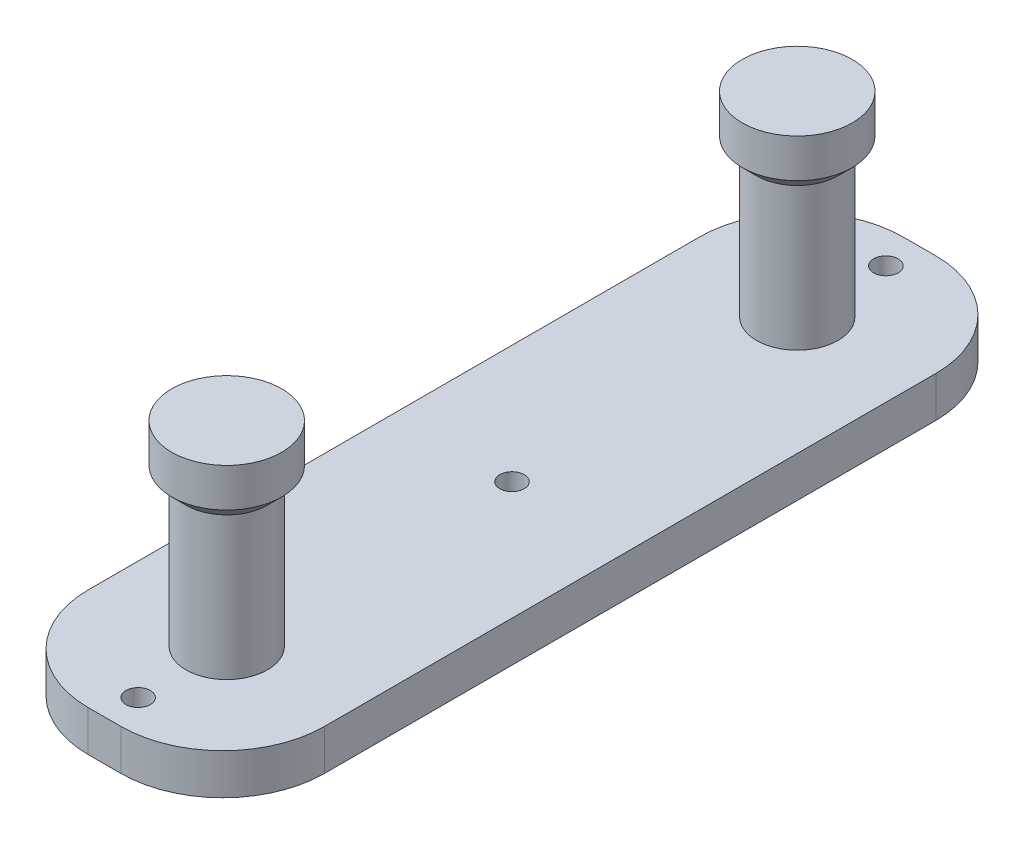
ISO-10303-21;
HEADER;
FILE_DESCRIPTION(('STEP AP214'),'2;1');
FILE_NAME('part.step','',(''),(''),'','','');
FILE_SCHEMA(('AUTOMOTIVE_DESIGN { 1 0 10303 214 1 1 1 1 }'));
ENDSEC;
DATA;
#1=APPLICATION_CONTEXT('core data for automotive mechanical design processes');
#2=APPLICATION_PROTOCOL_DEFINITION('international standard','automotive_design',2000,#1);
#3=PRODUCT_CONTEXT('',#1,'mechanical');
#4=PRODUCT('Part','Part','',(#3));
#5=PRODUCT_RELATED_PRODUCT_CATEGORY('part','',(#4));
#6=PRODUCT_DEFINITION_FORMATION('','',#4);
#7=PRODUCT_DEFINITION_CONTEXT('part definition',#1,'design');
#8=PRODUCT_DEFINITION('design','',#6,#7);
#9=PRODUCT_DEFINITION_SHAPE('','',#8);
#10=(LENGTH_UNIT() NAMED_UNIT(*) SI_UNIT(.MILLI.,.METRE.));
#11=(NAMED_UNIT(*) PLANE_ANGLE_UNIT() SI_UNIT($,.RADIAN.));
#12=(NAMED_UNIT(*) SI_UNIT($,.STERADIAN.) SOLID_ANGLE_UNIT());
#13=UNCERTAINTY_MEASURE_WITH_UNIT(LENGTH_MEASURE(1.E-05),#10,'distance_accuracy_value','');
#14=(GEOMETRIC_REPRESENTATION_CONTEXT(3) GLOBAL_UNCERTAINTY_ASSIGNED_CONTEXT((#13)) GLOBAL_UNIT_ASSIGNED_CONTEXT((#10,
#11,#12)) REPRESENTATION_CONTEXT('',''));
#15=CARTESIAN_POINT('',(0.,0.,0.));
#16=DIRECTION('',(0.,0.,1.));
#17=DIRECTION('',(1.,0.,0.));
#18=AXIS2_PLACEMENT_3D('',#15,#16,#17);
#19=CARTESIAN_POINT('',(-27.6995515695067,10.,0.));
#20=DIRECTION('',(1.,0.,0.));
#21=DIRECTION('',(0.,0.,-1.));
#22=AXIS2_PLACEMENT_3D('',#19,#20,#21);
#23=PLANE('',#22);
#24=DIRECTION('',(0.,0.,1.));
#25=VECTOR('',#24,1.);
#26=CARTESIAN_POINT('',(-27.6995515695067,10.,0.));
#27=LINE('',#26,#25);
#28=CARTESIAN_POINT('',(-27.6995515695067,10.,-5.23542600896859));
#29=VERTEX_POINT('',#28);
#30=CARTESIAN_POINT('',(-27.6995515695067,10.,144.764573991031));
#31=VERTEX_POINT('',#30);
#32=EDGE_CURVE('E131',#29,#31,#27,.T.);
#33=ORIENTED_EDGE('',*,*,#32,.F.);
#34=DIRECTION('',(0.,-1.,0.));
#35=VECTOR('',#34,1.);
#36=CARTESIAN_POINT('',(-27.6995515695067,0.,-5.23542600896859));
#37=LINE('',#36,#35);
#38=CARTESIAN_POINT('',(-27.6995515695067,0.,-5.23542600896859));
#39=VERTEX_POINT('',#38);
#40=EDGE_CURVE('E116',#29,#39,#37,.T.);
#41=ORIENTED_EDGE('',*,*,#40,.T.);
#42=DIRECTION('',(0.,0.,1.));
#43=VECTOR('',#42,1.);
#44=CARTESIAN_POINT('',(-27.6995515695067,0.,0.));
#45=LINE('',#44,#43);
#46=CARTESIAN_POINT('',(-27.6995515695067,0.,144.764573991031));
#47=VERTEX_POINT('',#46);
#48=EDGE_CURVE('E128',#39,#47,#45,.T.);
#49=ORIENTED_EDGE('',*,*,#48,.T.);
#50=DIRECTION('',(0.,-1.,0.));
#51=VECTOR('',#50,1.);
#52=CARTESIAN_POINT('',(-27.6995515695067,10.,144.764573991031));
#53=LINE('',#52,#51);
#54=EDGE_CURVE('E133',#47,#31,#53,.F.);
#55=ORIENTED_EDGE('',*,*,#54,.T.);
#56=EDGE_LOOP('',(#33,#41,#49,#55));
#57=FACE_BOUND('',#56,.T.);
#58=ADVANCED_FACE('F45',(#57),#23,.F.);
#59=CARTESIAN_POINT('',(0.,10.,169.764573991031));
#60=DIRECTION('',(0.,0.,-1.));
#61=DIRECTION('',(-1.,0.,0.));
#62=AXIS2_PLACEMENT_3D('',#59,#60,#61);
#63=PLANE('',#62);
#64=DIRECTION('',(1.,0.,0.));
#65=VECTOR('',#64,1.);
#66=CARTESIAN_POINT('',(0.,10.,169.764573991031));
#67=LINE('',#66,#65);
#68=CARTESIAN_POINT('',(-2.69955156950669,10.,169.764573991031));
#69=VERTEX_POINT('',#68);
#70=CARTESIAN_POINT('',(5.30044843049331,10.,169.764573991031));
#71=VERTEX_POINT('',#70);
#72=EDGE_CURVE('E188',#69,#71,#67,.T.);
#73=ORIENTED_EDGE('',*,*,#72,.F.);
#74=DIRECTION('',(0.,-1.,0.));
#75=VECTOR('',#74,1.);
#76=CARTESIAN_POINT('',(-2.69955156950669,10.,169.764573991031));
#77=LINE('',#76,#75);
#78=CARTESIAN_POINT('',(-2.69955156950669,0.,169.764573991031));
#79=VERTEX_POINT('',#78);
#80=EDGE_CURVE('E11',#69,#79,#77,.T.);
#81=ORIENTED_EDGE('',*,*,#80,.T.);
#82=DIRECTION('',(1.,0.,0.));
#83=VECTOR('',#82,1.);
#84=CARTESIAN_POINT('',(0.,0.,169.764573991031));
#85=LINE('',#84,#83);
#86=CARTESIAN_POINT('',(5.30044843049331,0.,169.764573991031));
#87=VERTEX_POINT('',#86);
#88=EDGE_CURVE('E138',#79,#87,#85,.T.);
#89=ORIENTED_EDGE('',*,*,#88,.T.);
#90=DIRECTION('',(0.,-1.,0.));
#91=VECTOR('',#90,1.);
#92=CARTESIAN_POINT('',(5.30044843049331,10.,169.764573991031));
#93=LINE('',#92,#91);
#94=EDGE_CURVE('E53',#87,#71,#93,.F.);
#95=ORIENTED_EDGE('',*,*,#94,.T.);
#96=EDGE_LOOP('',(#73,#81,#89,#95));
#97=FACE_BOUND('',#96,.T.);
#98=ADVANCED_FACE('F187',(#97),#63,.F.);
#99=CARTESIAN_POINT('',(30.3004484304933,10.,0.));
#100=DIRECTION('',(1.,0.,0.));
#101=DIRECTION('',(0.,0.,-1.));
#102=AXIS2_PLACEMENT_3D('',#99,#100,#101);
#103=PLANE('',#102);
#104=DIRECTION('',(0.,0.,1.));
#105=VECTOR('',#104,1.);
#106=CARTESIAN_POINT('',(30.3004484304933,0.,0.));
#107=LINE('',#106,#105);
#108=CARTESIAN_POINT('',(30.3004484304933,0.,-5.2354260089686));
#109=VERTEX_POINT('',#108);
#110=CARTESIAN_POINT('',(30.3004484304933,0.,144.764573991031));
#111=VERTEX_POINT('',#110);
#112=EDGE_CURVE('E142',#109,#111,#107,.T.);
#113=ORIENTED_EDGE('',*,*,#112,.F.);
#114=DIRECTION('',(0.,-1.,0.));
#115=VECTOR('',#114,1.);
#116=CARTESIAN_POINT('',(30.3004484304933,10.,-5.2354260089686));
#117=LINE('',#116,#115);
#118=CARTESIAN_POINT('',(30.3004484304933,10.,-5.2354260089686));
#119=VERTEX_POINT('',#118);
#120=EDGE_CURVE('E67',#109,#119,#117,.F.);
#121=ORIENTED_EDGE('',*,*,#120,.T.);
#122=DIRECTION('',(0.,0.,1.));
#123=VECTOR('',#122,1.);
#124=CARTESIAN_POINT('',(30.3004484304933,10.,0.));
#125=LINE('',#124,#123);
#126=CARTESIAN_POINT('',(30.3004484304933,10.,144.764573991031));
#127=VERTEX_POINT('',#126);
#128=EDGE_CURVE('E194',#119,#127,#125,.T.);
#129=ORIENTED_EDGE('',*,*,#128,.T.);
#130=DIRECTION('',(0.,-1.,0.));
#131=VECTOR('',#130,1.);
#132=CARTESIAN_POINT('',(30.3004484304933,0.,144.764573991031));
#133=LINE('',#132,#131);
#134=EDGE_CURVE('E181',#127,#111,#133,.T.);
#135=ORIENTED_EDGE('',*,*,#134,.T.);
#136=EDGE_LOOP('',(#113,#121,#129,#135));
#137=FACE_BOUND('',#136,.T.);
#138=ADVANCED_FACE('F197',(#137),#103,.T.);
#139=CARTESIAN_POINT('',(0.,10.,-30.2354260089686));
#140=DIRECTION('',(0.,0.,-1.));
#141=DIRECTION('',(-1.,0.,0.));
#142=AXIS2_PLACEMENT_3D('',#139,#140,#141);
#143=PLANE('',#142);
#144=DIRECTION('',(1.,0.,0.));
#145=VECTOR('',#144,1.);
#146=CARTESIAN_POINT('',(0.,0.,-30.2354260089686));
#147=LINE('',#146,#145);
#148=CARTESIAN_POINT('',(-2.69955156950671,0.,-30.2354260089686));
#149=VERTEX_POINT('',#148);
#150=CARTESIAN_POINT('',(5.30044843049329,0.,-30.2354260089686));
#151=VERTEX_POINT('',#150);
#152=EDGE_CURVE('E153',#149,#151,#147,.T.);
#153=ORIENTED_EDGE('',*,*,#152,.F.);
#154=DIRECTION('',(0.,-1.,0.));
#155=VECTOR('',#154,1.);
#156=CARTESIAN_POINT('',(-2.69955156950671,10.,-30.2354260089686));
#157=LINE('',#156,#155);
#158=CARTESIAN_POINT('',(-2.69955156950671,10.,-30.2354260089686));
#159=VERTEX_POINT('',#158);
#160=EDGE_CURVE('E117',#149,#159,#157,.F.);
#161=ORIENTED_EDGE('',*,*,#160,.T.);
#162=DIRECTION('',(1.,0.,0.));
#163=VECTOR('',#162,1.);
#164=CARTESIAN_POINT('',(0.,10.,-30.2354260089686));
#165=LINE('',#164,#163);
#166=CARTESIAN_POINT('',(5.30044843049329,10.,-30.2354260089686));
#167=VERTEX_POINT('',#166);
#168=EDGE_CURVE('E148',#159,#167,#165,.T.);
#169=ORIENTED_EDGE('',*,*,#168,.T.);
#170=DIRECTION('',(0.,-1.,0.));
#171=VECTOR('',#170,1.);
#172=CARTESIAN_POINT('',(5.30044843049329,10.,-30.2354260089686));
#173=LINE('',#172,#171);
#174=EDGE_CURVE('E122',#167,#151,#173,.T.);
#175=ORIENTED_EDGE('',*,*,#174,.T.);
#176=EDGE_LOOP('',(#153,#161,#169,#175));
#177=FACE_BOUND('',#176,.T.);
#178=ADVANCED_FACE('F204',(#177),#143,.T.);
#179=CARTESIAN_POINT('',(0.,10.,0.));
#180=DIRECTION('',(0.,1.,0.));
#181=DIRECTION('',(0.,0.,1.));
#182=AXIS2_PLACEMENT_3D('',#179,#180,#181);
#183=PLANE('',#182);
#184=CARTESIAN_POINT('',(1.30044843049329,10.,-21.9854260089686));
#185=DIRECTION('',(0.,1.,0.));
#186=DIRECTION('',(0.,0.,1.));
#187=AXIS2_PLACEMENT_3D('',#184,#185,#186);
#188=CIRCLE('',#187,3.);
#189=CARTESIAN_POINT('',(1.30044843049329,10.,-18.9854260089686));
#190=VERTEX_POINT('',#189);
#191=EDGE_CURVE('E228',#190,#190,#188,.T.);
#192=ORIENTED_EDGE('',*,*,#191,.F.);
#193=EDGE_LOOP('',(#192));
#194=FACE_BOUND('',#193,.T.);
#195=CARTESIAN_POINT('',(1.30044843049329,10.,69.7645739910314));
#196=DIRECTION('',(0.,1.,0.));
#197=DIRECTION('',(0.,0.,1.));
#198=AXIS2_PLACEMENT_3D('',#195,#196,#197);
#199=CIRCLE('',#198,3.);
#200=CARTESIAN_POINT('',(1.30044843049329,10.,72.7645739910314));
#201=VERTEX_POINT('',#200);
#202=EDGE_CURVE('E222',#201,#201,#199,.T.);
#203=ORIENTED_EDGE('',*,*,#202,.F.);
#204=EDGE_LOOP('',(#203));
#205=FACE_BOUND('',#204,.T.);
#206=CARTESIAN_POINT('',(1.30044843049331,10.,161.514573991031));
#207=DIRECTION('',(0.,1.,0.));
#208=DIRECTION('',(0.,0.,1.));
#209=AXIS2_PLACEMENT_3D('',#206,#207,#208);
#210=CIRCLE('',#209,3.);
#211=CARTESIAN_POINT('',(1.30044843049331,10.,164.514573991031));
#212=VERTEX_POINT('',#211);
#213=EDGE_CURVE('E216',#212,#212,#210,.T.);
#214=ORIENTED_EDGE('',*,*,#213,.F.);
#215=EDGE_LOOP('',(#214));
#216=FACE_BOUND('',#215,.T.);
#217=CARTESIAN_POINT('',(1.3004484304933,10.,139.764573991031));
#218=DIRECTION('',(0.,1.,0.));
#219=DIRECTION('',(0.,0.,1.));
#220=AXIS2_PLACEMENT_3D('',#217,#218,#219);
#221=CIRCLE('',#220,10.);
#222=CARTESIAN_POINT('',(1.3004484304933,10.,149.764573991031));
#223=VERTEX_POINT('',#222);
#224=EDGE_CURVE('E145',#223,#223,#221,.F.);
#225=ORIENTED_EDGE('',*,*,#224,.T.);
#226=EDGE_LOOP('',(#225));
#227=FACE_BOUND('',#226,.T.);
#228=CARTESIAN_POINT('',(1.30044843049329,10.,-0.235426008968601));
#229=DIRECTION('',(0.,1.,0.));
#230=DIRECTION('',(0.,0.,1.));
#231=AXIS2_PLACEMENT_3D('',#228,#229,#230);
#232=CIRCLE('',#231,10.);
#233=CARTESIAN_POINT('',(1.30044843049329,10.,9.76457399103141));
#234=VERTEX_POINT('',#233);
#235=EDGE_CURVE('E139',#234,#234,#232,.F.);
#236=ORIENTED_EDGE('',*,*,#235,.T.);
#237=EDGE_LOOP('',(#236));
#238=FACE_BOUND('',#237,.T.);
#239=ORIENTED_EDGE('',*,*,#168,.F.);
#240=CARTESIAN_POINT('',(-2.69955156950671,10.,-5.2354260089686));
#241=DIRECTION('',(0.,1.,0.));
#242=DIRECTION('',(0.,0.,1.));
#243=AXIS2_PLACEMENT_3D('',#240,#241,#242);
#244=CIRCLE('',#243,25.);
#245=EDGE_CURVE('E179',#159,#29,#244,.T.);
#246=ORIENTED_EDGE('',*,*,#245,.T.);
#247=ORIENTED_EDGE('',*,*,#32,.T.);
#248=CARTESIAN_POINT('',(-2.69955156950669,10.,144.764573991031));
#249=DIRECTION('',(0.,1.,0.));
#250=DIRECTION('',(0.,0.,1.));
#251=AXIS2_PLACEMENT_3D('',#248,#249,#250);
#252=CIRCLE('',#251,25.);
#253=EDGE_CURVE('E175',#31,#69,#252,.T.);
#254=ORIENTED_EDGE('',*,*,#253,.T.);
#255=ORIENTED_EDGE('',*,*,#72,.T.);
#256=CARTESIAN_POINT('',(5.30044843049331,10.,144.764573991031));
#257=DIRECTION('',(0.,1.,0.));
#258=DIRECTION('',(0.,0.,1.));
#259=AXIS2_PLACEMENT_3D('',#256,#257,#258);
#260=CIRCLE('',#259,25.);
#261=EDGE_CURVE('E60',#71,#127,#260,.T.);
#262=ORIENTED_EDGE('',*,*,#261,.T.);
#263=ORIENTED_EDGE('',*,*,#128,.F.);
#264=CARTESIAN_POINT('',(5.30044843049329,10.,-5.2354260089686));
#265=DIRECTION('',(0.,1.,0.));
#266=DIRECTION('',(0.,0.,1.));
#267=AXIS2_PLACEMENT_3D('',#264,#265,#266);
#268=CIRCLE('',#267,25.);
#269=EDGE_CURVE('E177',#119,#167,#268,.T.);
#270=ORIENTED_EDGE('',*,*,#269,.T.);
#271=EDGE_LOOP('',(#239,#246,#247,#254,#255,#262,#263,#270));
#272=FACE_BOUND('',#271,.T.);
#273=ADVANCED_FACE('F192',(#194,#205,#216,#227,#238,#272),#183,.T.);
#274=CARTESIAN_POINT('',(0.,0.,0.));
#275=DIRECTION('',(0.,1.,0.));
#276=DIRECTION('',(0.,0.,1.));
#277=AXIS2_PLACEMENT_3D('',#274,#275,#276);
#278=PLANE('',#277);
#279=CARTESIAN_POINT('',(1.30044843049329,0.,-21.9854260089686));
#280=DIRECTION('',(0.,1.,0.));
#281=DIRECTION('',(0.,0.,1.));
#282=AXIS2_PLACEMENT_3D('',#279,#280,#281);
#283=CIRCLE('',#282,3.);
#284=CARTESIAN_POINT('',(1.30044843049329,0.,-18.9854260089686));
#285=VERTEX_POINT('',#284);
#286=EDGE_CURVE('E215',#285,#285,#283,.T.);
#287=ORIENTED_EDGE('',*,*,#286,.T.);
#288=EDGE_LOOP('',(#287));
#289=FACE_BOUND('',#288,.T.);
#290=CARTESIAN_POINT('',(1.30044843049329,0.,69.7645739910314));
#291=DIRECTION('',(0.,1.,0.));
#292=DIRECTION('',(0.,0.,1.));
#293=AXIS2_PLACEMENT_3D('',#290,#291,#292);
#294=CIRCLE('',#293,3.);
#295=CARTESIAN_POINT('',(1.30044843049329,0.,72.7645739910314));
#296=VERTEX_POINT('',#295);
#297=EDGE_CURVE('E225',#296,#296,#294,.T.);
#298=ORIENTED_EDGE('',*,*,#297,.T.);
#299=EDGE_LOOP('',(#298));
#300=FACE_BOUND('',#299,.T.);
#301=CARTESIAN_POINT('',(1.30044843049331,0.,161.514573991031));
#302=DIRECTION('',(0.,1.,0.));
#303=DIRECTION('',(0.,0.,1.));
#304=AXIS2_PLACEMENT_3D('',#301,#302,#303);
#305=CIRCLE('',#304,3.);
#306=CARTESIAN_POINT('',(1.30044843049331,0.,164.514573991031));
#307=VERTEX_POINT('',#306);
#308=EDGE_CURVE('E219',#307,#307,#305,.T.);
#309=ORIENTED_EDGE('',*,*,#308,.T.);
#310=EDGE_LOOP('',(#309));
#311=FACE_BOUND('',#310,.T.);
#312=ORIENTED_EDGE('',*,*,#48,.F.);
#313=CARTESIAN_POINT('',(-2.69955156950671,0.,-5.2354260089686));
#314=DIRECTION('',(0.,1.,0.));
#315=DIRECTION('',(0.,0.,1.));
#316=AXIS2_PLACEMENT_3D('',#313,#314,#315);
#317=CIRCLE('',#316,25.);
#318=EDGE_CURVE('E112',#39,#149,#317,.F.);
#319=ORIENTED_EDGE('',*,*,#318,.T.);
#320=ORIENTED_EDGE('',*,*,#152,.T.);
#321=CARTESIAN_POINT('',(5.30044843049329,0.,-5.2354260089686));
#322=DIRECTION('',(0.,1.,0.));
#323=DIRECTION('',(0.,0.,1.));
#324=AXIS2_PLACEMENT_3D('',#321,#322,#323);
#325=CIRCLE('',#324,25.);
#326=EDGE_CURVE('E123',#151,#109,#325,.F.);
#327=ORIENTED_EDGE('',*,*,#326,.T.);
#328=ORIENTED_EDGE('',*,*,#112,.T.);
#329=CARTESIAN_POINT('',(5.30044843049331,0.,144.764573991031));
#330=DIRECTION('',(0.,1.,0.));
#331=DIRECTION('',(0.,0.,1.));
#332=AXIS2_PLACEMENT_3D('',#329,#330,#331);
#333=CIRCLE('',#332,25.);
#334=EDGE_CURVE('E132',#111,#87,#333,.F.);
#335=ORIENTED_EDGE('',*,*,#334,.T.);
#336=ORIENTED_EDGE('',*,*,#88,.F.);
#337=CARTESIAN_POINT('',(-2.69955156950669,0.,144.764573991031));
#338=DIRECTION('',(0.,1.,0.));
#339=DIRECTION('',(0.,0.,1.));
#340=AXIS2_PLACEMENT_3D('',#337,#338,#339);
#341=CIRCLE('',#340,25.);
#342=EDGE_CURVE('E137',#79,#47,#341,.F.);
#343=ORIENTED_EDGE('',*,*,#342,.T.);
#344=EDGE_LOOP('',(#312,#319,#320,#327,#328,#335,#336,#343));
#345=FACE_BOUND('',#344,.T.);
#346=ADVANCED_FACE('F135',(#289,#300,#311,#345),#278,.F.);
#347=CARTESIAN_POINT('',(1.30044843049329,50.,-0.235426008968601));
#348=DIRECTION('',(0.,-1.,0.));
#349=DIRECTION('',(0.,0.,-1.));
#350=AXIS2_PLACEMENT_3D('',#347,#348,#349);
#351=CYLINDRICAL_SURFACE('',#350,10.);
#352=CARTESIAN_POINT('',(1.30044843049329,45.,-0.235426008968601));
#353=DIRECTION('',(0.,1.,0.));
#354=DIRECTION('',(0.,0.,1.));
#355=AXIS2_PLACEMENT_3D('',#352,#353,#354);
#356=CIRCLE('',#355,10.);
#357=CARTESIAN_POINT('',(1.30044843049329,45.,9.76457399103141));
#358=VERTEX_POINT('',#357);
#359=EDGE_CURVE('E155',#358,#358,#356,.F.);
#360=ORIENTED_EDGE('',*,*,#359,.T.);
#361=EDGE_LOOP('',(#360));
#362=FACE_BOUND('',#361,.T.);
#363=ORIENTED_EDGE('',*,*,#235,.F.);
#364=EDGE_LOOP('',(#363));
#365=FACE_BOUND('',#364,.T.);
#366=ADVANCED_FACE('F254',(#362,#365),#351,.T.);
#367=CARTESIAN_POINT('',(1.3004484304933,50.,139.764573991031));
#368=DIRECTION('',(0.,-1.,0.));
#369=DIRECTION('',(0.,0.,-1.));
#370=AXIS2_PLACEMENT_3D('',#367,#368,#369);
#371=CYLINDRICAL_SURFACE('',#370,10.);
#372=CARTESIAN_POINT('',(1.3004484304933,45.,139.764573991031));
#373=DIRECTION('',(0.,1.,0.));
#374=DIRECTION('',(0.,0.,1.));
#375=AXIS2_PLACEMENT_3D('',#372,#373,#374);
#376=CIRCLE('',#375,10.);
#377=CARTESIAN_POINT('',(1.3004484304933,45.,149.764573991031));
#378=VERTEX_POINT('',#377);
#379=EDGE_CURVE('E158',#378,#378,#376,.F.);
#380=ORIENTED_EDGE('',*,*,#379,.T.);
#381=EDGE_LOOP('',(#380));
#382=FACE_BOUND('',#381,.T.);
#383=ORIENTED_EDGE('',*,*,#224,.F.);
#384=EDGE_LOOP('',(#383));
#385=FACE_BOUND('',#384,.T.);
#386=ADVANCED_FACE('F256',(#382,#385),#371,.T.);
#387=CARTESIAN_POINT('',(1.30044843049329,58.,-0.235426008968601));
#388=DIRECTION('',(0.,-1.,0.));
#389=DIRECTION('',(0.,0.,-1.));
#390=AXIS2_PLACEMENT_3D('',#387,#388,#389);
#391=CYLINDRICAL_SURFACE('',#390,13.5);
#392=CARTESIAN_POINT('',(1.30044843049329,48.4999999999999,-0.235426008968601));
#393=DIRECTION('',(0.,1.,0.));
#394=DIRECTION('',(0.,0.,1.));
#395=AXIS2_PLACEMENT_3D('',#392,#393,#394);
#396=CIRCLE('',#395,13.5);
#397=CARTESIAN_POINT('',(1.30044843049329,48.4999999999999,13.2645739910314));
#398=VERTEX_POINT('',#397);
#399=EDGE_CURVE('E161',#398,#398,#396,.T.);
#400=ORIENTED_EDGE('',*,*,#399,.T.);
#401=EDGE_LOOP('',(#400));
#402=FACE_BOUND('',#401,.T.);
#403=CARTESIAN_POINT('',(1.30044843049329,58.,-0.235426008968601));
#404=DIRECTION('',(0.,1.,0.));
#405=DIRECTION('',(0.,0.,1.));
#406=AXIS2_PLACEMENT_3D('',#403,#404,#405);
#407=CIRCLE('',#406,13.5);
#408=CARTESIAN_POINT('',(1.30044843049329,58.,13.2645739910314));
#409=VERTEX_POINT('',#408);
#410=EDGE_CURVE('E209',#409,#409,#407,.T.);
#411=ORIENTED_EDGE('',*,*,#410,.F.);
#412=EDGE_LOOP('',(#411));
#413=FACE_BOUND('',#412,.T.);
#414=ADVANCED_FACE('F263',(#402,#413),#391,.T.);
#415=CARTESIAN_POINT('',(1.30044843049329,58.,-0.235426008968601));
#416=DIRECTION('',(0.,1.,0.));
#417=DIRECTION('',(0.,0.,1.));
#418=AXIS2_PLACEMENT_3D('',#415,#416,#417);
#419=PLANE('',#418);
#420=ORIENTED_EDGE('',*,*,#410,.T.);
#421=EDGE_LOOP('',(#420));
#422=FACE_BOUND('',#421,.T.);
#423=ADVANCED_FACE('F318',(#422),#419,.T.);
#424=CARTESIAN_POINT('',(1.3004484304933,58.,139.764573991031));
#425=DIRECTION('',(0.,-1.,0.));
#426=DIRECTION('',(0.,0.,-1.));
#427=AXIS2_PLACEMENT_3D('',#424,#425,#426);
#428=CYLINDRICAL_SURFACE('',#427,13.5);
#429=CARTESIAN_POINT('',(1.3004484304933,48.4999999999999,139.764573991031));
#430=DIRECTION('',(0.,1.,0.));
#431=DIRECTION('',(0.,0.,1.));
#432=AXIS2_PLACEMENT_3D('',#429,#430,#431);
#433=CIRCLE('',#432,13.5);
#434=CARTESIAN_POINT('',(1.3004484304933,48.4999999999999,153.264573991031));
#435=VERTEX_POINT('',#434);
#436=EDGE_CURVE('E164',#435,#435,#433,.T.);
#437=ORIENTED_EDGE('',*,*,#436,.T.);
#438=EDGE_LOOP('',(#437));
#439=FACE_BOUND('',#438,.T.);
#440=CARTESIAN_POINT('',(1.3004484304933,58.,139.764573991031));
#441=DIRECTION('',(0.,1.,0.));
#442=DIRECTION('',(0.,0.,1.));
#443=AXIS2_PLACEMENT_3D('',#440,#441,#442);
#444=CIRCLE('',#443,13.5);
#445=CARTESIAN_POINT('',(1.3004484304933,58.,153.264573991031));
#446=VERTEX_POINT('',#445);
#447=EDGE_CURVE('E212',#446,#446,#444,.T.);
#448=ORIENTED_EDGE('',*,*,#447,.F.);
#449=EDGE_LOOP('',(#448));
#450=FACE_BOUND('',#449,.T.);
#451=ADVANCED_FACE('F315',(#439,#450),#428,.T.);
#452=CARTESIAN_POINT('',(1.3004484304933,58.,139.764573991031));
#453=DIRECTION('',(0.,1.,0.));
#454=DIRECTION('',(0.,0.,1.));
#455=AXIS2_PLACEMENT_3D('',#452,#453,#454);
#456=PLANE('',#455);
#457=ORIENTED_EDGE('',*,*,#447,.T.);
#458=EDGE_LOOP('',(#457));
#459=FACE_BOUND('',#458,.T.);
#460=ADVANCED_FACE('F283',(#459),#456,.T.);
#461=CARTESIAN_POINT('',(1.30044843049329,50.,-0.235426008968601));
#462=DIRECTION('',(0.,1.,0.));
#463=DIRECTION('',(0.,0.,1.));
#464=AXIS2_PLACEMENT_3D('',#461,#462,#463);
#465=CONICAL_SURFACE('',#464,15.0000000000001,0.785398163397454);
#466=ORIENTED_EDGE('',*,*,#359,.F.);
#467=EDGE_LOOP('',(#466));
#468=FACE_BOUND('',#467,.T.);
#469=ORIENTED_EDGE('',*,*,#399,.F.);
#470=EDGE_LOOP('',(#469));
#471=FACE_BOUND('',#470,.T.);
#472=ADVANCED_FACE('F276',(#468,#471),#465,.T.);
#473=CARTESIAN_POINT('',(1.3004484304933,50.,139.764573991031));
#474=DIRECTION('',(0.,1.,0.));
#475=DIRECTION('',(0.,0.,1.));
#476=AXIS2_PLACEMENT_3D('',#473,#474,#475);
#477=CONICAL_SURFACE('',#476,15.0000000000001,0.785398163397454);
#478=ORIENTED_EDGE('',*,*,#379,.F.);
#479=EDGE_LOOP('',(#478));
#480=FACE_BOUND('',#479,.T.);
#481=ORIENTED_EDGE('',*,*,#436,.F.);
#482=EDGE_LOOP('',(#481));
#483=FACE_BOUND('',#482,.T.);
#484=ADVANCED_FACE('F282',(#480,#483),#477,.T.);
#485=CARTESIAN_POINT('',(-2.69955156950671,10.,-5.2354260089686));
#486=DIRECTION('',(0.,1.,0.));
#487=DIRECTION('',(0.,0.,1.));
#488=AXIS2_PLACEMENT_3D('',#485,#486,#487);
#489=CYLINDRICAL_SURFACE('',#488,25.);
#490=ORIENTED_EDGE('',*,*,#245,.F.);
#491=ORIENTED_EDGE('',*,*,#160,.F.);
#492=ORIENTED_EDGE('',*,*,#318,.F.);
#493=ORIENTED_EDGE('',*,*,#40,.F.);
#494=EDGE_LOOP('',(#490,#491,#492,#493));
#495=FACE_BOUND('',#494,.T.);
#496=ADVANCED_FACE('F115',(#495),#489,.T.);
#497=CARTESIAN_POINT('',(5.30044843049329,10.,-5.2354260089686));
#498=DIRECTION('',(0.,-1.,0.));
#499=DIRECTION('',(0.,0.,-1.));
#500=AXIS2_PLACEMENT_3D('',#497,#498,#499);
#501=CYLINDRICAL_SURFACE('',#500,25.);
#502=ORIENTED_EDGE('',*,*,#269,.F.);
#503=ORIENTED_EDGE('',*,*,#120,.F.);
#504=ORIENTED_EDGE('',*,*,#326,.F.);
#505=ORIENTED_EDGE('',*,*,#174,.F.);
#506=EDGE_LOOP('',(#502,#503,#504,#505));
#507=FACE_BOUND('',#506,.T.);
#508=ADVANCED_FACE('F201',(#507),#501,.T.);
#509=CARTESIAN_POINT('',(-2.69955156950669,10.,144.764573991031));
#510=DIRECTION('',(0.,-1.,0.));
#511=DIRECTION('',(0.,0.,-1.));
#512=AXIS2_PLACEMENT_3D('',#509,#510,#511);
#513=CYLINDRICAL_SURFACE('',#512,25.);
#514=ORIENTED_EDGE('',*,*,#253,.F.);
#515=ORIENTED_EDGE('',*,*,#54,.F.);
#516=ORIENTED_EDGE('',*,*,#342,.F.);
#517=ORIENTED_EDGE('',*,*,#80,.F.);
#518=EDGE_LOOP('',(#514,#515,#516,#517));
#519=FACE_BOUND('',#518,.T.);
#520=ADVANCED_FACE('F293',(#519),#513,.T.);
#521=CARTESIAN_POINT('',(5.30044843049331,10.,144.764573991031));
#522=DIRECTION('',(0.,1.,0.));
#523=DIRECTION('',(0.,0.,1.));
#524=AXIS2_PLACEMENT_3D('',#521,#522,#523);
#525=CYLINDRICAL_SURFACE('',#524,25.);
#526=ORIENTED_EDGE('',*,*,#261,.F.);
#527=ORIENTED_EDGE('',*,*,#94,.F.);
#528=ORIENTED_EDGE('',*,*,#334,.F.);
#529=ORIENTED_EDGE('',*,*,#134,.F.);
#530=EDGE_LOOP('',(#526,#527,#528,#529));
#531=FACE_BOUND('',#530,.T.);
#532=ADVANCED_FACE('F47',(#531),#525,.T.);
#533=CARTESIAN_POINT('',(1.30044843049331,0.,161.514573991031));
#534=DIRECTION('',(0.,1.,0.));
#535=DIRECTION('',(0.,0.,1.));
#536=AXIS2_PLACEMENT_3D('',#533,#534,#535);
#537=CYLINDRICAL_SURFACE('',#536,3.);
#538=ORIENTED_EDGE('',*,*,#308,.F.);
#539=EDGE_LOOP('',(#538));
#540=FACE_BOUND('',#539,.T.);
#541=ORIENTED_EDGE('',*,*,#213,.T.);
#542=EDGE_LOOP('',(#541));
#543=FACE_BOUND('',#542,.T.);
#544=ADVANCED_FACE('F299',(#540,#543),#537,.F.);
#545=CARTESIAN_POINT('',(1.30044843049329,0.,69.7645739910314));
#546=DIRECTION('',(0.,1.,0.));
#547=DIRECTION('',(0.,0.,1.));
#548=AXIS2_PLACEMENT_3D('',#545,#546,#547);
#549=CYLINDRICAL_SURFACE('',#548,3.);
#550=ORIENTED_EDGE('',*,*,#297,.F.);
#551=EDGE_LOOP('',(#550));
#552=FACE_BOUND('',#551,.T.);
#553=ORIENTED_EDGE('',*,*,#202,.T.);
#554=EDGE_LOOP('',(#553));
#555=FACE_BOUND('',#554,.T.);
#556=ADVANCED_FACE('F239',(#552,#555),#549,.F.);
#557=CARTESIAN_POINT('',(1.30044843049329,0.,-21.9854260089686));
#558=DIRECTION('',(0.,1.,0.));
#559=DIRECTION('',(0.,0.,1.));
#560=AXIS2_PLACEMENT_3D('',#557,#558,#559);
#561=CYLINDRICAL_SURFACE('',#560,3.);
#562=ORIENTED_EDGE('',*,*,#286,.F.);
#563=EDGE_LOOP('',(#562));
#564=FACE_BOUND('',#563,.T.);
#565=ORIENTED_EDGE('',*,*,#191,.T.);
#566=EDGE_LOOP('',(#565));
#567=FACE_BOUND('',#566,.T.);
#568=ADVANCED_FACE('F236',(#564,#567),#561,.F.);
#569=CLOSED_SHELL('',(#58,#98,#138,#178,#273,#346,#366,#386,#414,#423,#451,#460,#472,#484,#496,
#508,#520,#532,#544,#556,#568));
#570=MANIFOLD_SOLID_BREP('B2',#569);
#571=ADVANCED_BREP_SHAPE_REPRESENTATION('',(#18,#570),#14);
#572=SHAPE_DEFINITION_REPRESENTATION(#9,#571);
ENDSEC;
END-ISO-10303-21;
